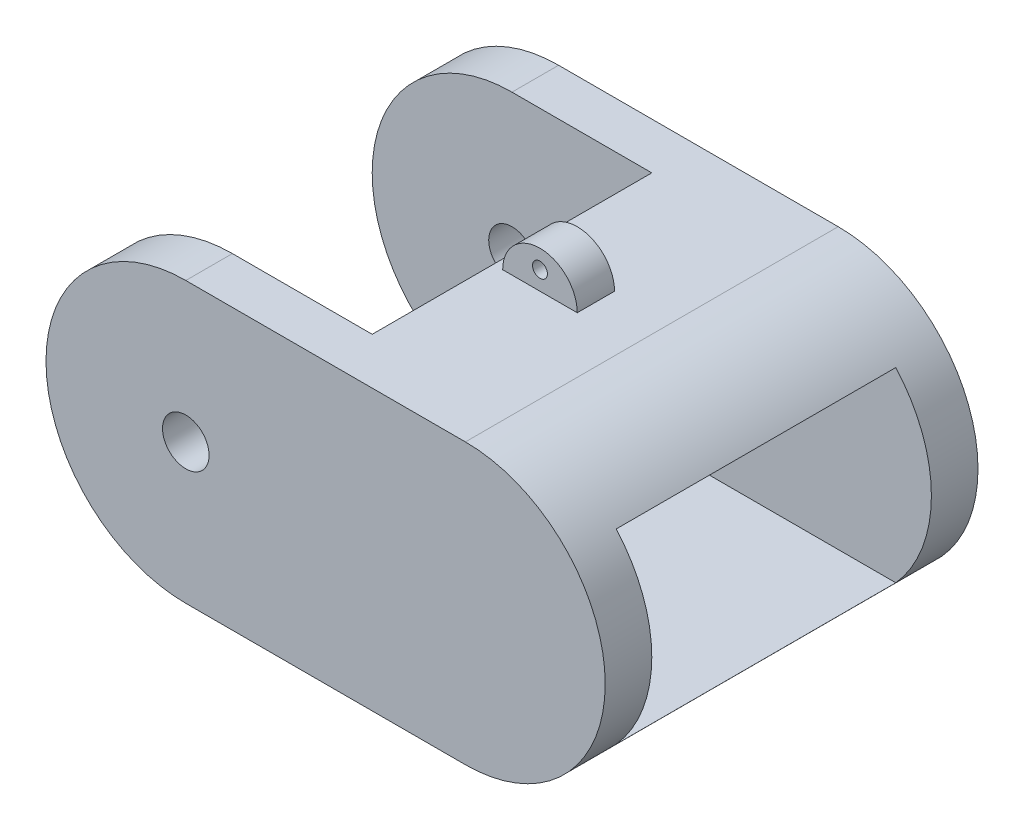
ISO-10303-21;
HEADER;
FILE_DESCRIPTION(('STEP AP214'),'2;1');
FILE_NAME('part.step','',(''),(''),'','','');
FILE_SCHEMA(('AUTOMOTIVE_DESIGN { 1 0 10303 214 1 1 1 1 }'));
ENDSEC;
DATA;
#1=APPLICATION_CONTEXT('core data for automotive mechanical design processes');
#2=APPLICATION_PROTOCOL_DEFINITION('international standard','automotive_design',2000,#1);
#3=PRODUCT_CONTEXT('',#1,'mechanical');
#4=PRODUCT('Part','Part','',(#3));
#5=PRODUCT_RELATED_PRODUCT_CATEGORY('part','',(#4));
#6=PRODUCT_DEFINITION_FORMATION('','',#4);
#7=PRODUCT_DEFINITION_CONTEXT('part definition',#1,'design');
#8=PRODUCT_DEFINITION('design','',#6,#7);
#9=PRODUCT_DEFINITION_SHAPE('','',#8);
#10=(LENGTH_UNIT() NAMED_UNIT(*) SI_UNIT(.MILLI.,.METRE.));
#11=(NAMED_UNIT(*) PLANE_ANGLE_UNIT() SI_UNIT($,.RADIAN.));
#12=(NAMED_UNIT(*) SI_UNIT($,.STERADIAN.) SOLID_ANGLE_UNIT());
#13=UNCERTAINTY_MEASURE_WITH_UNIT(LENGTH_MEASURE(1.E-05),#10,'distance_accuracy_value','');
#14=(GEOMETRIC_REPRESENTATION_CONTEXT(3) GLOBAL_UNCERTAINTY_ASSIGNED_CONTEXT((#13)) GLOBAL_UNIT_ASSIGNED_CONTEXT((#10,
#11,#12)) REPRESENTATION_CONTEXT('',''));
#15=CARTESIAN_POINT('',(0.,0.,0.));
#16=DIRECTION('',(0.,0.,1.));
#17=DIRECTION('',(1.,0.,0.));
#18=AXIS2_PLACEMENT_3D('',#15,#16,#17);
#19=CARTESIAN_POINT('',(-2.54,21.59,1.27));
#20=DIRECTION('',(0.,0.,-1.));
#21=DIRECTION('',(-1.,0.,0.));
#22=AXIS2_PLACEMENT_3D('',#19,#20,#21);
#23=PLANE('',#22);
#24=DIRECTION('',(1.,0.,0.));
#25=VECTOR('',#24,1.);
#26=CARTESIAN_POINT('',(-2.54,19.05,1.27));
#27=LINE('',#26,#25);
#28=CARTESIAN_POINT('',(-2.54,19.05,1.27));
#29=VERTEX_POINT('',#28);
#30=CARTESIAN_POINT('',(2.54,19.05,1.27));
#31=VERTEX_POINT('',#30);
#32=EDGE_CURVE('E291',#29,#31,#27,.T.);
#33=ORIENTED_EDGE('',*,*,#32,.T.);
#34=CARTESIAN_POINT('',(0.,19.05,1.27));
#35=DIRECTION('',(0.,0.,-1.));
#36=DIRECTION('',(-1.,0.,0.));
#37=AXIS2_PLACEMENT_3D('',#34,#35,#36);
#38=CIRCLE('',#37,2.54);
#39=EDGE_CURVE('E275',#31,#29,#38,.F.);
#40=ORIENTED_EDGE('',*,*,#39,.T.);
#41=EDGE_LOOP('',(#33,#40));
#42=FACE_BOUND('',#41,.T.);
#43=CARTESIAN_POINT('',(0.,20.32,1.27));
#44=DIRECTION('',(0.,0.,-1.));
#45=DIRECTION('',(-1.,0.,0.));
#46=AXIS2_PLACEMENT_3D('',#43,#44,#45);
#47=CIRCLE('',#46,0.508000000000001);
#48=CARTESIAN_POINT('',(-0.508000000000002,20.32,1.27));
#49=VERTEX_POINT('',#48);
#50=EDGE_CURVE('E274',#49,#49,#47,.T.);
#51=ORIENTED_EDGE('',*,*,#50,.T.);
#52=EDGE_LOOP('',(#51));
#53=FACE_BOUND('',#52,.T.);
#54=ADVANCED_FACE('F37',(#42,#53),#23,.F.);
#55=CARTESIAN_POINT('',(-2.54,21.59,-1.27));
#56=DIRECTION('',(0.,0.,1.));
#57=DIRECTION('',(1.,0.,0.));
#58=AXIS2_PLACEMENT_3D('',#55,#56,#57);
#59=PLANE('',#58);
#60=DIRECTION('',(-1.,0.,0.));
#61=VECTOR('',#60,1.);
#62=CARTESIAN_POINT('',(-2.54,19.05,-1.27));
#63=LINE('',#62,#61);
#64=CARTESIAN_POINT('',(2.54,19.05,-1.27));
#65=VERTEX_POINT('',#64);
#66=CARTESIAN_POINT('',(-2.54,19.05,-1.27));
#67=VERTEX_POINT('',#66);
#68=EDGE_CURVE('E294',#65,#67,#63,.T.);
#69=ORIENTED_EDGE('',*,*,#68,.T.);
#70=CARTESIAN_POINT('',(0.,19.05,-1.27));
#71=DIRECTION('',(0.,0.,1.));
#72=DIRECTION('',(1.,0.,0.));
#73=AXIS2_PLACEMENT_3D('',#70,#71,#72);
#74=CIRCLE('',#73,2.54);
#75=EDGE_CURVE('E281',#67,#65,#74,.F.);
#76=ORIENTED_EDGE('',*,*,#75,.T.);
#77=EDGE_LOOP('',(#69,#76));
#78=FACE_BOUND('',#77,.T.);
#79=CARTESIAN_POINT('',(0.,20.32,-1.27));
#80=DIRECTION('',(0.,0.,1.));
#81=DIRECTION('',(1.,0.,0.));
#82=AXIS2_PLACEMENT_3D('',#79,#80,#81);
#83=CIRCLE('',#82,0.508000000000001);
#84=CARTESIAN_POINT('',(0.508000000000001,20.32,-1.27));
#85=VERTEX_POINT('',#84);
#86=EDGE_CURVE('E272',#85,#85,#83,.T.);
#87=ORIENTED_EDGE('',*,*,#86,.T.);
#88=EDGE_LOOP('',(#87));
#89=FACE_BOUND('',#88,.T.);
#90=ADVANCED_FACE('F425',(#78,#89),#59,.F.);
#91=CARTESIAN_POINT('',(0.,19.05,0.));
#92=DIRECTION('',(0.,1.,0.));
#93=DIRECTION('',(0.,0.,1.));
#94=AXIS2_PLACEMENT_3D('',#91,#92,#93);
#95=PLANE('',#94);
#96=DIRECTION('',(-1.,0.,0.));
#97=VECTOR('',#96,1.);
#98=CARTESIAN_POINT('',(-12.7,19.05,-9.525));
#99=LINE('',#98,#97);
#100=CARTESIAN_POINT('',(-3.175,19.05,-9.525));
#101=VERTEX_POINT('',#100);
#102=CARTESIAN_POINT('',(-12.7,19.05,-9.525));
#103=VERTEX_POINT('',#102);
#104=EDGE_CURVE('E388',#101,#103,#99,.T.);
#105=ORIENTED_EDGE('',*,*,#104,.F.);
#106=DIRECTION('',(0.,0.,-1.));
#107=VECTOR('',#106,1.);
#108=CARTESIAN_POINT('',(-3.175,19.05,-9.525));
#109=LINE('',#108,#107);
#110=CARTESIAN_POINT('',(-3.175,19.05,9.525));
#111=VERTEX_POINT('',#110);
#112=EDGE_CURVE('E194',#111,#101,#109,.T.);
#113=ORIENTED_EDGE('',*,*,#112,.F.);
#114=DIRECTION('',(1.,0.,0.));
#115=VECTOR('',#114,1.);
#116=CARTESIAN_POINT('',(-12.7,19.05,9.525));
#117=LINE('',#116,#115);
#118=CARTESIAN_POINT('',(-12.7,19.05,9.525));
#119=VERTEX_POINT('',#118);
#120=EDGE_CURVE('E185',#119,#111,#117,.T.);
#121=ORIENTED_EDGE('',*,*,#120,.F.);
#122=DIRECTION('',(0.,0.,1.));
#123=VECTOR('',#122,1.);
#124=CARTESIAN_POINT('',(-12.7,19.05,-12.7));
#125=LINE('',#124,#123);
#126=CARTESIAN_POINT('',(-12.7,19.05,12.7));
#127=VERTEX_POINT('',#126);
#128=EDGE_CURVE('E191',#119,#127,#125,.T.);
#129=ORIENTED_EDGE('',*,*,#128,.T.);
#130=DIRECTION('',(1.,0.,0.));
#131=VECTOR('',#130,1.);
#132=CARTESIAN_POINT('',(-22.225,19.05,12.7));
#133=LINE('',#132,#131);
#134=CARTESIAN_POINT('',(6.35,19.05,12.7));
#135=VERTEX_POINT('',#134);
#136=EDGE_CURVE('E242',#127,#135,#133,.T.);
#137=ORIENTED_EDGE('',*,*,#136,.T.);
#138=DIRECTION('',(0.,0.,1.));
#139=VECTOR('',#138,1.);
#140=CARTESIAN_POINT('',(6.35,19.05,-12.7));
#141=LINE('',#140,#139);
#142=CARTESIAN_POINT('',(6.35,19.05,-12.7));
#143=VERTEX_POINT('',#142);
#144=EDGE_CURVE('E227',#143,#135,#141,.T.);
#145=ORIENTED_EDGE('',*,*,#144,.F.);
#146=DIRECTION('',(-1.,0.,0.));
#147=VECTOR('',#146,1.);
#148=CARTESIAN_POINT('',(-22.225,19.05,-12.7));
#149=LINE('',#148,#147);
#150=CARTESIAN_POINT('',(-12.7,19.05,-12.7));
#151=VERTEX_POINT('',#150);
#152=EDGE_CURVE('E244',#143,#151,#149,.T.);
#153=ORIENTED_EDGE('',*,*,#152,.T.);
#154=EDGE_CURVE('E213',#151,#103,#125,.T.);
#155=ORIENTED_EDGE('',*,*,#154,.T.);
#156=EDGE_LOOP('',(#105,#113,#121,#129,#137,#145,#153,#155));
#157=FACE_BOUND('',#156,.T.);
#158=ORIENTED_EDGE('',*,*,#32,.F.);
#159=DIRECTION('',(0.,0.,1.));
#160=VECTOR('',#159,1.);
#161=CARTESIAN_POINT('',(-2.54,19.05,-1.27));
#162=LINE('',#161,#160);
#163=EDGE_CURVE('E279',#67,#29,#162,.T.);
#164=ORIENTED_EDGE('',*,*,#163,.F.);
#165=ORIENTED_EDGE('',*,*,#68,.F.);
#166=DIRECTION('',(0.,0.,-1.));
#167=VECTOR('',#166,1.);
#168=CARTESIAN_POINT('',(2.54,19.05,-1.27));
#169=LINE('',#168,#167);
#170=EDGE_CURVE('E59',#31,#65,#169,.T.);
#171=ORIENTED_EDGE('',*,*,#170,.F.);
#172=EDGE_LOOP('',(#158,#164,#165,#171));
#173=FACE_BOUND('',#172,.T.);
#174=ADVANCED_FACE('F188',(#157,#173),#95,.T.);
#175=CARTESIAN_POINT('',(-6.35,-7.62,-1.90500000000001));
#176=DIRECTION('',(0.,0.,-1.));
#177=DIRECTION('',(-1.,0.,0.));
#178=AXIS2_PLACEMENT_3D('',#175,#176,#177);
#179=PLANE('',#178);
#180=CARTESIAN_POINT('',(-0.0861930186881812,-2.99485448456808,-1.90500000000001));
#181=DIRECTION('',(0.,0.,-1.));
#182=DIRECTION('',(-1.,0.,0.));
#183=AXIS2_PLACEMENT_3D('',#180,#181,#182);
#184=CIRCLE('',#183,4.34412957457592);
#185=CARTESIAN_POINT('',(-4.41362492439032,-2.614335283717,-1.90500000000002));
#186=VERTEX_POINT('',#185);
#187=CARTESIAN_POINT('',(-3.23298636699812,0.,-1.90500000000002));
#188=VERTEX_POINT('',#187);
#189=EDGE_CURVE('E323',#186,#188,#184,.T.);
#190=ORIENTED_EDGE('',*,*,#189,.F.);
#191=CARTESIAN_POINT('',(-2.26854868254507,-2.28495035036065,-1.90500000000001));
#192=DIRECTION('',(0.,0.,-1.));
#193=DIRECTION('',(-1.,0.,0.));
#194=AXIS2_PLACEMENT_3D('',#191,#192,#193);
#195=CIRCLE('',#194,2.17021808066635);
#196=CARTESIAN_POINT('',(-3.04450374837902,-4.31170644162021,-1.90500000000002));
#197=VERTEX_POINT('',#196);
#198=EDGE_CURVE('E325',#197,#186,#195,.T.);
#199=ORIENTED_EDGE('',*,*,#198,.F.);
#200=CARTESIAN_POINT('',(-3.3233412187691,-2.19000144979784,-1.90500000000001));
#201=DIRECTION('',(0.,0.,-1.));
#202=DIRECTION('',(-1.,0.,0.));
#203=AXIS2_PLACEMENT_3D('',#200,#201,#202);
#204=CIRCLE('',#203,2.13994915996094);
#205=CARTESIAN_POINT('',(-1.31460402965717,-2.92780719136958,-1.90500000000002));
#206=VERTEX_POINT('',#205);
#207=EDGE_CURVE('E327',#206,#197,#204,.T.);
#208=ORIENTED_EDGE('',*,*,#207,.F.);
#209=CARTESIAN_POINT('',(-1.96109230852822,-2.92882586705521,-1.90500000000001));
#210=DIRECTION('',(0.,0.,-1.));
#211=DIRECTION('',(-1.,0.,0.));
#212=AXIS2_PLACEMENT_3D('',#209,#210,#211);
#213=CIRCLE('',#212,0.646489081437423);
#214=CARTESIAN_POINT('',(-2.21183198517268,-2.33294186242509,-1.90500000000002));
#215=VERTEX_POINT('',#214);
#216=EDGE_CURVE('E329',#215,#206,#213,.T.);
#217=ORIENTED_EDGE('',*,*,#216,.F.);
#218=CARTESIAN_POINT('',(-2.0593410105954,-1.72984424301921,-1.90500000000001));
#219=DIRECTION('',(0.,0.,-1.));
#220=DIRECTION('',(-1.,0.,0.));
#221=AXIS2_PLACEMENT_3D('',#218,#219,#220);
#222=CIRCLE('',#221,0.622077355206385);
#223=CARTESIAN_POINT('',(-1.90685003601812,-1.12674662361332,-1.90500000000002));
#224=VERTEX_POINT('',#223);
#225=EDGE_CURVE('E331',#224,#215,#222,.F.);
#226=ORIENTED_EDGE('',*,*,#225,.F.);
#227=CARTESIAN_POINT('',(-1.81149307872842,-2.77193940872848,-1.90500000000001));
#228=DIRECTION('',(0.,0.,-1.));
#229=DIRECTION('',(-1.,0.,0.));
#230=AXIS2_PLACEMENT_3D('',#227,#228,#229);
#231=CIRCLE('',#230,1.64795395854936);
#232=CARTESIAN_POINT('',(-0.163539125899153,-2.77180210276902,-1.90500000000002));
#233=VERTEX_POINT('',#232);
#234=EDGE_CURVE('E333',#233,#224,#231,.F.);
#235=ORIENTED_EDGE('',*,*,#234,.F.);
#236=CARTESIAN_POINT('',(-3.15358954399178,-2.81445182249442,-1.90500000000001));
#237=DIRECTION('',(0.,0.,-1.));
#238=DIRECTION('',(-1.,0.,0.));
#239=AXIS2_PLACEMENT_3D('',#236,#237,#238);
#240=CIRCLE('',#239,2.99035457786005);
#241=CARTESIAN_POINT('',(-6.12706480359468,-3.13172990534612,-1.90500000000002));
#242=VERTEX_POINT('',#241);
#243=EDGE_CURVE('E301',#242,#233,#240,.F.);
#244=ORIENTED_EDGE('',*,*,#243,.F.);
#245=DIRECTION('',(0.0710062762211976,-0.997475868749314,0.));
#246=VECTOR('',#245,1.);
#247=CARTESIAN_POINT('',(-5.81029790139981,-7.58158078857746,-1.90500000000001));
#248=LINE('',#247,#246);
#249=CARTESIAN_POINT('',(-6.35,0.,-1.90500000000002));
#250=VERTEX_POINT('',#249);
#251=EDGE_CURVE('E321',#250,#242,#248,.T.);
#252=ORIENTED_EDGE('',*,*,#251,.F.);
#253=DIRECTION('',(-1.,0.,0.));
#254=VECTOR('',#253,1.);
#255=CARTESIAN_POINT('',(-6.35,0.,-1.90500000000001));
#256=LINE('',#255,#254);
#257=EDGE_CURVE('E341',#188,#250,#256,.T.);
#258=ORIENTED_EDGE('',*,*,#257,.F.);
#259=EDGE_LOOP('',(#190,#199,#208,#217,#226,#235,#244,#252,#258));
#260=FACE_BOUND('',#259,.T.);
#261=ADVANCED_FACE('F467',(#260),#179,.T.);
#262=CARTESIAN_POINT('',(-6.35,-7.62,1.90499999999999));
#263=DIRECTION('',(0.,0.,1.));
#264=DIRECTION('',(1.,0.,0.));
#265=AXIS2_PLACEMENT_3D('',#262,#263,#264);
#266=PLANE('',#265);
#267=CARTESIAN_POINT('',(-0.0861930186881812,-2.99485448456808,1.90499999999998));
#268=DIRECTION('',(0.,0.,1.));
#269=DIRECTION('',(1.,0.,0.));
#270=AXIS2_PLACEMENT_3D('',#267,#268,#269);
#271=CIRCLE('',#270,4.34412957457592);
#272=CARTESIAN_POINT('',(-3.23298636699812,0.,1.90499999999998));
#273=VERTEX_POINT('',#272);
#274=CARTESIAN_POINT('',(-4.41362492439032,-2.614335283717,1.90499999999998));
#275=VERTEX_POINT('',#274);
#276=EDGE_CURVE('E45',#273,#275,#271,.T.);
#277=ORIENTED_EDGE('',*,*,#276,.F.);
#278=DIRECTION('',(1.,0.,0.));
#279=VECTOR('',#278,1.);
#280=CARTESIAN_POINT('',(-6.35,0.,1.90499999999999));
#281=LINE('',#280,#279);
#282=CARTESIAN_POINT('',(-6.35,0.,1.90499999999998));
#283=VERTEX_POINT('',#282);
#284=EDGE_CURVE('E338',#283,#273,#281,.T.);
#285=ORIENTED_EDGE('',*,*,#284,.F.);
#286=DIRECTION('',(-0.0710062762211976,0.997475868749314,0.));
#287=VECTOR('',#286,1.);
#288=CARTESIAN_POINT('',(-5.81029790139981,-7.58158078857746,1.90499999999999));
#289=LINE('',#288,#287);
#290=CARTESIAN_POINT('',(-6.12706480359468,-3.13172990534612,1.90499999999998));
#291=VERTEX_POINT('',#290);
#292=EDGE_CURVE('E259',#291,#283,#289,.T.);
#293=ORIENTED_EDGE('',*,*,#292,.F.);
#294=CARTESIAN_POINT('',(-3.15358954399178,-2.81445182249442,1.90499999999998));
#295=DIRECTION('',(0.,0.,1.));
#296=DIRECTION('',(1.,0.,0.));
#297=AXIS2_PLACEMENT_3D('',#294,#295,#296);
#298=CIRCLE('',#297,2.99035457786005);
#299=CARTESIAN_POINT('',(-0.163539125899152,-2.77180210276902,1.90499999999998));
#300=VERTEX_POINT('',#299);
#301=EDGE_CURVE('E257',#300,#291,#298,.F.);
#302=ORIENTED_EDGE('',*,*,#301,.F.);
#303=CARTESIAN_POINT('',(-1.81149307872842,-2.77193940872848,1.90499999999998));
#304=DIRECTION('',(0.,0.,1.));
#305=DIRECTION('',(1.,0.,0.));
#306=AXIS2_PLACEMENT_3D('',#303,#304,#305);
#307=CIRCLE('',#306,1.64795395854936);
#308=CARTESIAN_POINT('',(-1.90685003601812,-1.12674662361332,1.90499999999998));
#309=VERTEX_POINT('',#308);
#310=EDGE_CURVE('E261',#309,#300,#307,.F.);
#311=ORIENTED_EDGE('',*,*,#310,.F.);
#312=CARTESIAN_POINT('',(-2.0593410105954,-1.72984424301921,1.90499999999998));
#313=DIRECTION('',(0.,0.,1.));
#314=DIRECTION('',(1.,0.,0.));
#315=AXIS2_PLACEMENT_3D('',#312,#313,#314);
#316=CIRCLE('',#315,0.622077355206385);
#317=CARTESIAN_POINT('',(-2.21183198517268,-2.33294186242509,1.90499999999998));
#318=VERTEX_POINT('',#317);
#319=EDGE_CURVE('E264',#318,#309,#316,.F.);
#320=ORIENTED_EDGE('',*,*,#319,.F.);
#321=CARTESIAN_POINT('',(-1.96109230852822,-2.92882586705521,1.90499999999998));
#322=DIRECTION('',(0.,0.,1.));
#323=DIRECTION('',(1.,0.,0.));
#324=AXIS2_PLACEMENT_3D('',#321,#322,#323);
#325=CIRCLE('',#324,0.646489081437423);
#326=CARTESIAN_POINT('',(-1.31460402965717,-2.92780719136958,1.90499999999998));
#327=VERTEX_POINT('',#326);
#328=EDGE_CURVE('E266',#327,#318,#325,.T.);
#329=ORIENTED_EDGE('',*,*,#328,.F.);
#330=CARTESIAN_POINT('',(-3.3233412187691,-2.19000144979784,1.90499999999998));
#331=DIRECTION('',(0.,0.,1.));
#332=DIRECTION('',(1.,0.,0.));
#333=AXIS2_PLACEMENT_3D('',#330,#331,#332);
#334=CIRCLE('',#333,2.13994915996094);
#335=CARTESIAN_POINT('',(-3.04450374837902,-4.31170644162021,1.90499999999998));
#336=VERTEX_POINT('',#335);
#337=EDGE_CURVE('E268',#336,#327,#334,.T.);
#338=ORIENTED_EDGE('',*,*,#337,.F.);
#339=CARTESIAN_POINT('',(-2.26854868254507,-2.28495035036065,1.90499999999998));
#340=DIRECTION('',(0.,0.,1.));
#341=DIRECTION('',(1.,0.,0.));
#342=AXIS2_PLACEMENT_3D('',#339,#340,#341);
#343=CIRCLE('',#342,2.17021808066635);
#344=EDGE_CURVE('E270',#275,#336,#343,.T.);
#345=ORIENTED_EDGE('',*,*,#344,.F.);
#346=EDGE_LOOP('',(#277,#285,#293,#302,#311,#320,#329,#338,#345));
#347=FACE_BOUND('',#346,.T.);
#348=ADVANCED_FACE('F470',(#347),#266,.T.);
#349=CARTESIAN_POINT('',(6.35,9.525,-12.7));
#350=DIRECTION('',(0.,0.,1.));
#351=DIRECTION('',(1.,0.,0.));
#352=AXIS2_PLACEMENT_3D('',#349,#350,#351);
#353=CYLINDRICAL_SURFACE('',#352,9.525);
#354=CARTESIAN_POINT('',(6.35,9.525,12.7));
#355=DIRECTION('',(0.,0.,-1.));
#356=DIRECTION('',(1.,0.,0.));
#357=AXIS2_PLACEMENT_3D('',#354,#355,#356);
#358=CIRCLE('',#357,9.525);
#359=CARTESIAN_POINT('',(6.34999999999999,0.,12.7));
#360=VERTEX_POINT('',#359);
#361=EDGE_CURVE('E228',#135,#360,#358,.T.);
#362=ORIENTED_EDGE('',*,*,#361,.T.);
#363=DIRECTION('',(0.,0.,1.));
#364=VECTOR('',#363,1.);
#365=CARTESIAN_POINT('',(6.35,0.,-12.7));
#366=LINE('',#365,#364);
#367=CARTESIAN_POINT('',(6.35,0.,-12.7));
#368=VERTEX_POINT('',#367);
#369=EDGE_CURVE('E231',#368,#360,#366,.T.);
#370=ORIENTED_EDGE('',*,*,#369,.F.);
#371=CARTESIAN_POINT('',(6.35,9.525,-12.7));
#372=DIRECTION('',(0.,0.,-1.));
#373=DIRECTION('',(1.,0.,0.));
#374=AXIS2_PLACEMENT_3D('',#371,#372,#373);
#375=CIRCLE('',#374,9.525);
#376=EDGE_CURVE('E224',#143,#368,#375,.T.);
#377=ORIENTED_EDGE('',*,*,#376,.F.);
#378=ORIENTED_EDGE('',*,*,#144,.T.);
#379=EDGE_LOOP('',(#362,#370,#377,#378));
#380=FACE_BOUND('',#379,.T.);
#381=CARTESIAN_POINT('',(6.35,9.525,-9.525));
#382=DIRECTION('',(0.,0.,1.));
#383=DIRECTION('',(0.,-1.,0.));
#384=AXIS2_PLACEMENT_3D('',#381,#382,#383);
#385=CIRCLE('',#384,9.525);
#386=CARTESIAN_POINT('',(13.4495158285618,3.175,-9.525));
#387=VERTEX_POINT('',#386);
#388=CARTESIAN_POINT('',(13.4495158285618,15.875,-9.525));
#389=VERTEX_POINT('',#388);
#390=EDGE_CURVE('E363',#387,#389,#385,.T.);
#391=ORIENTED_EDGE('',*,*,#390,.F.);
#392=DIRECTION('',(0.,0.,1.));
#393=VECTOR('',#392,1.);
#394=CARTESIAN_POINT('',(13.4495158285618,3.175,-12.7));
#395=LINE('',#394,#393);
#396=CARTESIAN_POINT('',(13.4495158285618,3.175,9.525));
#397=VERTEX_POINT('',#396);
#398=EDGE_CURVE('E356',#397,#387,#395,.F.);
#399=ORIENTED_EDGE('',*,*,#398,.F.);
#400=CARTESIAN_POINT('',(6.35,9.525,9.525));
#401=DIRECTION('',(0.,0.,-1.));
#402=DIRECTION('',(0.,1.,0.));
#403=AXIS2_PLACEMENT_3D('',#400,#401,#402);
#404=CIRCLE('',#403,9.525);
#405=CARTESIAN_POINT('',(13.4495158285618,15.875,9.525));
#406=VERTEX_POINT('',#405);
#407=EDGE_CURVE('E360',#406,#397,#404,.T.);
#408=ORIENTED_EDGE('',*,*,#407,.F.);
#409=DIRECTION('',(0.,0.,1.));
#410=VECTOR('',#409,1.);
#411=CARTESIAN_POINT('',(13.4495158285618,15.875,-12.7));
#412=LINE('',#411,#410);
#413=EDGE_CURVE('E358',#389,#406,#412,.T.);
#414=ORIENTED_EDGE('',*,*,#413,.F.);
#415=EDGE_LOOP('',(#391,#399,#408,#414));
#416=FACE_BOUND('',#415,.T.);
#417=ADVANCED_FACE('F384',(#380,#416),#353,.T.);
#418=CARTESIAN_POINT('',(-12.7,9.525,-12.7));
#419=DIRECTION('',(0.,0.,1.));
#420=DIRECTION('',(1.,0.,0.));
#421=AXIS2_PLACEMENT_3D('',#418,#419,#420);
#422=CYLINDRICAL_SURFACE('',#421,1.5875);
#423=CARTESIAN_POINT('',(-12.7,9.525,-12.7));
#424=DIRECTION('',(0.,0.,1.));
#425=DIRECTION('',(1.,0.,0.));
#426=AXIS2_PLACEMENT_3D('',#423,#424,#425);
#427=CIRCLE('',#426,1.5875);
#428=CARTESIAN_POINT('',(-11.1125,9.525,-12.7));
#429=VERTEX_POINT('',#428);
#430=EDGE_CURVE('E236',#429,#429,#427,.T.);
#431=ORIENTED_EDGE('',*,*,#430,.F.);
#432=EDGE_LOOP('',(#431));
#433=FACE_BOUND('',#432,.T.);
#434=CARTESIAN_POINT('',(-12.7,9.525,-9.525));
#435=DIRECTION('',(0.,0.,-1.));
#436=DIRECTION('',(-1.,0.,0.));
#437=AXIS2_PLACEMENT_3D('',#434,#435,#436);
#438=CIRCLE('',#437,1.5875);
#439=CARTESIAN_POINT('',(-14.2875,9.525,-9.525));
#440=VERTEX_POINT('',#439);
#441=EDGE_CURVE('E254',#440,#440,#438,.F.);
#442=ORIENTED_EDGE('',*,*,#441,.T.);
#443=EDGE_LOOP('',(#442));
#444=FACE_BOUND('',#443,.T.);
#445=ADVANCED_FACE('F490',(#433,#444),#422,.F.);
#446=CARTESIAN_POINT('',(-12.7,9.525,12.7));
#447=DIRECTION('',(0.,0.,1.));
#448=DIRECTION('',(1.,0.,0.));
#449=AXIS2_PLACEMENT_3D('',#446,#447,#448);
#450=CIRCLE('',#449,1.5875);
#451=CARTESIAN_POINT('',(-11.1125,9.525,12.7));
#452=VERTEX_POINT('',#451);
#453=EDGE_CURVE('E217',#452,#452,#450,.T.);
#454=ORIENTED_EDGE('',*,*,#453,.T.);
#455=EDGE_LOOP('',(#454));
#456=FACE_BOUND('',#455,.T.);
#457=CARTESIAN_POINT('',(-12.7,9.525,9.525));
#458=DIRECTION('',(0.,0.,1.));
#459=DIRECTION('',(1.,0.,0.));
#460=AXIS2_PLACEMENT_3D('',#457,#458,#459);
#461=CIRCLE('',#460,1.5875);
#462=CARTESIAN_POINT('',(-11.1125,9.525,9.525));
#463=VERTEX_POINT('',#462);
#464=EDGE_CURVE('E248',#463,#463,#461,.F.);
#465=ORIENTED_EDGE('',*,*,#464,.T.);
#466=EDGE_LOOP('',(#465));
#467=FACE_BOUND('',#466,.T.);
#468=ADVANCED_FACE('F481',(#456,#467),#422,.F.);
#469=CARTESIAN_POINT('',(-12.7,0.,-9.525));
#470=DIRECTION('',(1.,0.,0.));
#471=DIRECTION('',(0.,0.,-1.));
#472=AXIS2_PLACEMENT_3D('',#469,#470,#471);
#473=PLANE('',#472);
#474=DIRECTION('',(0.,0.,1.));
#475=VECTOR('',#474,1.);
#476=CARTESIAN_POINT('',(-12.7,3.175,-9.525));
#477=LINE('',#476,#475);
#478=CARTESIAN_POINT('',(-12.7,3.175,-9.525));
#479=VERTEX_POINT('',#478);
#480=CARTESIAN_POINT('',(-12.7,3.175,9.525));
#481=VERTEX_POINT('',#480);
#482=EDGE_CURVE('E354',#479,#481,#477,.T.);
#483=ORIENTED_EDGE('',*,*,#482,.F.);
#484=DIRECTION('',(0.,1.,0.));
#485=VECTOR('',#484,1.);
#486=CARTESIAN_POINT('',(-12.7,0.,-9.525));
#487=LINE('',#486,#485);
#488=CARTESIAN_POINT('',(-12.7,0.,-9.525));
#489=VERTEX_POINT('',#488);
#490=EDGE_CURVE('E207',#489,#479,#487,.T.);
#491=ORIENTED_EDGE('',*,*,#490,.F.);
#492=DIRECTION('',(0.,0.,-1.));
#493=VECTOR('',#492,1.);
#494=CARTESIAN_POINT('',(-12.7,0.,-9.525));
#495=LINE('',#494,#493);
#496=CARTESIAN_POINT('',(-12.7,0.,9.525));
#497=VERTEX_POINT('',#496);
#498=EDGE_CURVE('E365',#497,#489,#495,.T.);
#499=ORIENTED_EDGE('',*,*,#498,.F.);
#500=DIRECTION('',(0.,1.,0.));
#501=VECTOR('',#500,1.);
#502=CARTESIAN_POINT('',(-12.7,0.,9.525));
#503=LINE('',#502,#501);
#504=EDGE_CURVE('E202',#497,#481,#503,.T.);
#505=ORIENTED_EDGE('',*,*,#504,.T.);
#506=EDGE_LOOP('',(#483,#491,#499,#505));
#507=FACE_BOUND('',#506,.T.);
#508=ADVANCED_FACE('F399',(#507),#473,.F.);
#509=CARTESIAN_POINT('',(-12.7,9.525,-12.7));
#510=DIRECTION('',(0.,0.,1.));
#511=DIRECTION('',(1.,0.,0.));
#512=AXIS2_PLACEMENT_3D('',#509,#510,#511);
#513=CYLINDRICAL_SURFACE('',#512,9.525);
#514=DIRECTION('',(0.,0.,1.));
#515=VECTOR('',#514,1.);
#516=CARTESIAN_POINT('',(-12.7,0.,-12.7));
#517=LINE('',#516,#515);
#518=CARTESIAN_POINT('',(-12.7,0.,-12.7));
#519=VERTEX_POINT('',#518);
#520=EDGE_CURVE('E214',#519,#489,#517,.T.);
#521=ORIENTED_EDGE('',*,*,#520,.T.);
#522=CARTESIAN_POINT('',(-12.7,9.525,-9.525));
#523=DIRECTION('',(0.,0.,-1.));
#524=DIRECTION('',(-1.,0.,0.));
#525=AXIS2_PLACEMENT_3D('',#522,#523,#524);
#526=CIRCLE('',#525,9.525);
#527=EDGE_CURVE('E206',#489,#103,#526,.T.);
#528=ORIENTED_EDGE('',*,*,#527,.T.);
#529=ORIENTED_EDGE('',*,*,#154,.F.);
#530=CARTESIAN_POINT('',(-12.7,9.525,-12.7));
#531=DIRECTION('',(0.,0.,-1.));
#532=DIRECTION('',(1.,0.,0.));
#533=AXIS2_PLACEMENT_3D('',#530,#531,#532);
#534=CIRCLE('',#533,9.525);
#535=EDGE_CURVE('E371',#519,#151,#534,.T.);
#536=ORIENTED_EDGE('',*,*,#535,.F.);
#537=EDGE_LOOP('',(#521,#528,#529,#536));
#538=FACE_BOUND('',#537,.T.);
#539=ADVANCED_FACE('F390',(#538),#513,.T.);
#540=CARTESIAN_POINT('',(0.,0.,0.));
#541=DIRECTION('',(0.,1.,0.));
#542=DIRECTION('',(0.,0.,1.));
#543=AXIS2_PLACEMENT_3D('',#540,#541,#542);
#544=PLANE('',#543);
#545=ORIENTED_EDGE('',*,*,#369,.T.);
#546=DIRECTION('',(1.,0.,0.));
#547=VECTOR('',#546,1.);
#548=CARTESIAN_POINT('',(-22.225,0.,12.7));
#549=LINE('',#548,#547);
#550=CARTESIAN_POINT('',(-12.7,0.,12.7));
#551=VERTEX_POINT('',#550);
#552=EDGE_CURVE('E239',#551,#360,#549,.T.);
#553=ORIENTED_EDGE('',*,*,#552,.F.);
#554=EDGE_CURVE('E219',#497,#551,#517,.T.);
#555=ORIENTED_EDGE('',*,*,#554,.F.);
#556=ORIENTED_EDGE('',*,*,#498,.T.);
#557=ORIENTED_EDGE('',*,*,#520,.F.);
#558=DIRECTION('',(-1.,0.,0.));
#559=VECTOR('',#558,1.);
#560=CARTESIAN_POINT('',(-22.225,0.,-12.7));
#561=LINE('',#560,#559);
#562=EDGE_CURVE('E245',#368,#519,#561,.T.);
#563=ORIENTED_EDGE('',*,*,#562,.F.);
#564=EDGE_LOOP('',(#545,#553,#555,#556,#557,#563));
#565=FACE_BOUND('',#564,.T.);
#566=DIRECTION('',(0.,0.,1.));
#567=VECTOR('',#566,1.);
#568=CARTESIAN_POINT('',(-3.23298636699812,0.,-6.35));
#569=LINE('',#568,#567);
#570=EDGE_CURVE('E314',#188,#273,#569,.T.);
#571=ORIENTED_EDGE('',*,*,#570,.F.);
#572=ORIENTED_EDGE('',*,*,#257,.T.);
#573=DIRECTION('',(0.,0.,1.));
#574=VECTOR('',#573,1.);
#575=CARTESIAN_POINT('',(-6.35,0.,1.90499999999999));
#576=LINE('',#575,#574);
#577=EDGE_CURVE('E335',#250,#283,#576,.T.);
#578=ORIENTED_EDGE('',*,*,#577,.T.);
#579=ORIENTED_EDGE('',*,*,#284,.T.);
#580=EDGE_LOOP('',(#571,#572,#578,#579));
#581=FACE_BOUND('',#580,.T.);
#582=ADVANCED_FACE('F379',(#565,#581),#544,.F.);
#583=CARTESIAN_POINT('',(-22.225,19.05,12.7));
#584=DIRECTION('',(0.,0.,-1.));
#585=DIRECTION('',(-1.,0.,0.));
#586=AXIS2_PLACEMENT_3D('',#583,#584,#585);
#587=PLANE('',#586);
#588=ORIENTED_EDGE('',*,*,#453,.F.);
#589=EDGE_LOOP('',(#588));
#590=FACE_BOUND('',#589,.T.);
#591=ORIENTED_EDGE('',*,*,#552,.T.);
#592=ORIENTED_EDGE('',*,*,#361,.F.);
#593=ORIENTED_EDGE('',*,*,#136,.F.);
#594=CARTESIAN_POINT('',(-12.7,9.525,12.7));
#595=DIRECTION('',(0.,0.,-1.));
#596=DIRECTION('',(1.,0.,0.));
#597=AXIS2_PLACEMENT_3D('',#594,#595,#596);
#598=CIRCLE('',#597,9.525);
#599=EDGE_CURVE('E211',#551,#127,#598,.T.);
#600=ORIENTED_EDGE('',*,*,#599,.F.);
#601=EDGE_LOOP('',(#591,#592,#593,#600));
#602=FACE_BOUND('',#601,.T.);
#603=ADVANCED_FACE('F39',(#590,#602),#587,.F.);
#604=CARTESIAN_POINT('',(-22.225,19.05,-12.7));
#605=DIRECTION('',(0.,0.,1.));
#606=DIRECTION('',(1.,0.,0.));
#607=AXIS2_PLACEMENT_3D('',#604,#605,#606);
#608=PLANE('',#607);
#609=ORIENTED_EDGE('',*,*,#430,.T.);
#610=EDGE_LOOP('',(#609));
#611=FACE_BOUND('',#610,.T.);
#612=ORIENTED_EDGE('',*,*,#152,.F.);
#613=ORIENTED_EDGE('',*,*,#376,.T.);
#614=ORIENTED_EDGE('',*,*,#562,.T.);
#615=ORIENTED_EDGE('',*,*,#535,.T.);
#616=EDGE_LOOP('',(#612,#613,#614,#615));
#617=FACE_BOUND('',#616,.T.);
#618=ADVANCED_FACE('F387',(#611,#617),#608,.F.);
#619=ORIENTED_EDGE('',*,*,#128,.F.);
#620=CARTESIAN_POINT('',(-12.7,9.525,9.525));
#621=DIRECTION('',(0.,0.,1.));
#622=DIRECTION('',(1.,0.,0.));
#623=AXIS2_PLACEMENT_3D('',#620,#621,#622);
#624=CIRCLE('',#623,9.525);
#625=EDGE_CURVE('E197',#119,#497,#624,.T.);
#626=ORIENTED_EDGE('',*,*,#625,.T.);
#627=ORIENTED_EDGE('',*,*,#554,.T.);
#628=ORIENTED_EDGE('',*,*,#599,.T.);
#629=EDGE_LOOP('',(#619,#626,#627,#628));
#630=FACE_BOUND('',#629,.T.);
#631=ADVANCED_FACE('F209',(#630),#513,.T.);
#632=CARTESIAN_POINT('',(-24.8084462993451,0.,-9.525));
#633=DIRECTION('',(0.,0.,-1.));
#634=DIRECTION('',(-1.,0.,0.));
#635=AXIS2_PLACEMENT_3D('',#632,#633,#634);
#636=PLANE('',#635);
#637=ORIENTED_EDGE('',*,*,#104,.T.);
#638=ORIENTED_EDGE('',*,*,#527,.F.);
#639=ORIENTED_EDGE('',*,*,#490,.T.);
#640=DIRECTION('',(-1.,0.,0.));
#641=VECTOR('',#640,1.);
#642=CARTESIAN_POINT('',(34.925,3.175,-9.525));
#643=LINE('',#642,#641);
#644=EDGE_CURVE('E344',#387,#479,#643,.T.);
#645=ORIENTED_EDGE('',*,*,#644,.F.);
#646=ORIENTED_EDGE('',*,*,#390,.T.);
#647=DIRECTION('',(-1.,0.,0.));
#648=VECTOR('',#647,1.);
#649=CARTESIAN_POINT('',(34.925,15.875,-9.525));
#650=LINE('',#649,#648);
#651=CARTESIAN_POINT('',(-3.175,15.875,-9.525));
#652=VERTEX_POINT('',#651);
#653=EDGE_CURVE('E351',#389,#652,#650,.T.);
#654=ORIENTED_EDGE('',*,*,#653,.T.);
#655=DIRECTION('',(0.,1.,0.));
#656=VECTOR('',#655,1.);
#657=CARTESIAN_POINT('',(-3.175,15.24,-9.525));
#658=LINE('',#657,#656);
#659=EDGE_CURVE('E286',#652,#101,#658,.T.);
#660=ORIENTED_EDGE('',*,*,#659,.T.);
#661=EDGE_LOOP('',(#637,#638,#639,#645,#646,#654,#660));
#662=FACE_BOUND('',#661,.T.);
#663=ORIENTED_EDGE('',*,*,#441,.F.);
#664=EDGE_LOOP('',(#663));
#665=FACE_BOUND('',#664,.T.);
#666=ADVANCED_FACE('F394',(#662,#665),#636,.F.);
#667=CARTESIAN_POINT('',(-12.7,0.,9.525));
#668=DIRECTION('',(0.,0.,1.));
#669=DIRECTION('',(1.,0.,0.));
#670=AXIS2_PLACEMENT_3D('',#667,#668,#669);
#671=PLANE('',#670);
#672=ORIENTED_EDGE('',*,*,#625,.F.);
#673=ORIENTED_EDGE('',*,*,#120,.T.);
#674=DIRECTION('',(0.,1.,0.));
#675=VECTOR('',#674,1.);
#676=CARTESIAN_POINT('',(-3.175,15.24,9.525));
#677=LINE('',#676,#675);
#678=CARTESIAN_POINT('',(-3.175,15.875,9.525));
#679=VERTEX_POINT('',#678);
#680=EDGE_CURVE('E52',#679,#111,#677,.T.);
#681=ORIENTED_EDGE('',*,*,#680,.F.);
#682=DIRECTION('',(-1.,0.,0.));
#683=VECTOR('',#682,1.);
#684=CARTESIAN_POINT('',(34.925,15.875,9.525));
#685=LINE('',#684,#683);
#686=EDGE_CURVE('E348',#406,#679,#685,.T.);
#687=ORIENTED_EDGE('',*,*,#686,.F.);
#688=ORIENTED_EDGE('',*,*,#407,.T.);
#689=DIRECTION('',(-1.,0.,0.));
#690=VECTOR('',#689,1.);
#691=CARTESIAN_POINT('',(34.925,3.175,9.525));
#692=LINE('',#691,#690);
#693=EDGE_CURVE('E346',#397,#481,#692,.T.);
#694=ORIENTED_EDGE('',*,*,#693,.T.);
#695=ORIENTED_EDGE('',*,*,#504,.F.);
#696=EDGE_LOOP('',(#672,#673,#681,#687,#688,#694,#695));
#697=FACE_BOUND('',#696,.T.);
#698=ORIENTED_EDGE('',*,*,#464,.F.);
#699=EDGE_LOOP('',(#698));
#700=FACE_BOUND('',#699,.T.);
#701=ADVANCED_FACE('F198',(#697,#700),#671,.F.);
#702=CARTESIAN_POINT('',(34.925,15.875,-9.525));
#703=DIRECTION('',(0.,-1.,0.));
#704=DIRECTION('',(0.,0.,-1.));
#705=AXIS2_PLACEMENT_3D('',#702,#703,#704);
#706=PLANE('',#705);
#707=DIRECTION('',(0.,0.,1.));
#708=VECTOR('',#707,1.);
#709=CARTESIAN_POINT('',(-3.175,15.875,-9.525));
#710=LINE('',#709,#708);
#711=EDGE_CURVE('E11',#652,#679,#710,.T.);
#712=ORIENTED_EDGE('',*,*,#711,.F.);
#713=ORIENTED_EDGE('',*,*,#653,.F.);
#714=ORIENTED_EDGE('',*,*,#413,.T.);
#715=ORIENTED_EDGE('',*,*,#686,.T.);
#716=EDGE_LOOP('',(#712,#713,#714,#715));
#717=FACE_BOUND('',#716,.T.);
#718=ADVANCED_FACE('F409',(#717),#706,.T.);
#719=CARTESIAN_POINT('',(34.925,3.175,-9.525));
#720=DIRECTION('',(0.,1.,0.));
#721=DIRECTION('',(0.,0.,1.));
#722=AXIS2_PLACEMENT_3D('',#719,#720,#721);
#723=PLANE('',#722);
#724=ORIENTED_EDGE('',*,*,#398,.T.);
#725=ORIENTED_EDGE('',*,*,#644,.T.);
#726=ORIENTED_EDGE('',*,*,#482,.T.);
#727=ORIENTED_EDGE('',*,*,#693,.F.);
#728=EDGE_LOOP('',(#724,#725,#726,#727));
#729=FACE_BOUND('',#728,.T.);
#730=ADVANCED_FACE('F401',(#729),#723,.T.);
#731=CARTESIAN_POINT('',(-1.81149307872842,-2.77193940872848,-6.35));
#732=DIRECTION('',(0.,0.,1.));
#733=DIRECTION('',(1.,0.,0.));
#734=AXIS2_PLACEMENT_3D('',#731,#732,#733);
#735=CYLINDRICAL_SURFACE('',#734,1.64795395854936);
#736=ORIENTED_EDGE('',*,*,#234,.T.);
#737=DIRECTION('',(0.,0.,1.));
#738=VECTOR('',#737,1.);
#739=CARTESIAN_POINT('',(-1.90685003601812,-1.12674662361332,-6.35));
#740=LINE('',#739,#738);
#741=EDGE_CURVE('E298',#224,#309,#740,.T.);
#742=ORIENTED_EDGE('',*,*,#741,.T.);
#743=ORIENTED_EDGE('',*,*,#310,.T.);
#744=DIRECTION('',(0.,0.,1.));
#745=VECTOR('',#744,1.);
#746=CARTESIAN_POINT('',(-0.163539125899153,-2.77180210276902,-6.35));
#747=LINE('',#746,#745);
#748=EDGE_CURVE('E297',#233,#300,#747,.T.);
#749=ORIENTED_EDGE('',*,*,#748,.F.);
#750=EDGE_LOOP('',(#736,#742,#743,#749));
#751=FACE_BOUND('',#750,.T.);
#752=ADVANCED_FACE('F439',(#751),#735,.T.);
#753=CARTESIAN_POINT('',(-2.0593410105954,-1.72984424301921,-6.35));
#754=DIRECTION('',(0.,0.,1.));
#755=DIRECTION('',(1.,0.,0.));
#756=AXIS2_PLACEMENT_3D('',#753,#754,#755);
#757=CYLINDRICAL_SURFACE('',#756,0.622077355206385);
#758=ORIENTED_EDGE('',*,*,#225,.T.);
#759=DIRECTION('',(0.,0.,1.));
#760=VECTOR('',#759,1.);
#761=CARTESIAN_POINT('',(-2.21183198517268,-2.33294186242509,-6.35));
#762=LINE('',#761,#760);
#763=EDGE_CURVE('E302',#215,#318,#762,.T.);
#764=ORIENTED_EDGE('',*,*,#763,.T.);
#765=ORIENTED_EDGE('',*,*,#319,.T.);
#766=ORIENTED_EDGE('',*,*,#741,.F.);
#767=EDGE_LOOP('',(#758,#764,#765,#766));
#768=FACE_BOUND('',#767,.T.);
#769=ADVANCED_FACE('F435',(#768),#757,.T.);
#770=CARTESIAN_POINT('',(-1.96109230852822,-2.92882586705521,-6.35));
#771=DIRECTION('',(0.,0.,1.));
#772=DIRECTION('',(1.,0.,0.));
#773=AXIS2_PLACEMENT_3D('',#770,#771,#772);
#774=CYLINDRICAL_SURFACE('',#773,0.646489081437423);
#775=ORIENTED_EDGE('',*,*,#216,.T.);
#776=DIRECTION('',(0.,0.,1.));
#777=VECTOR('',#776,1.);
#778=CARTESIAN_POINT('',(-1.31460402965717,-2.92780719136958,-6.35));
#779=LINE('',#778,#777);
#780=EDGE_CURVE('E305',#206,#327,#779,.T.);
#781=ORIENTED_EDGE('',*,*,#780,.T.);
#782=ORIENTED_EDGE('',*,*,#328,.T.);
#783=ORIENTED_EDGE('',*,*,#763,.F.);
#784=EDGE_LOOP('',(#775,#781,#782,#783));
#785=FACE_BOUND('',#784,.T.);
#786=ADVANCED_FACE('F438',(#785),#774,.F.);
#787=CARTESIAN_POINT('',(-3.3233412187691,-2.19000144979784,-6.35));
#788=DIRECTION('',(0.,0.,1.));
#789=DIRECTION('',(1.,0.,0.));
#790=AXIS2_PLACEMENT_3D('',#787,#788,#789);
#791=CYLINDRICAL_SURFACE('',#790,2.13994915996094);
#792=ORIENTED_EDGE('',*,*,#207,.T.);
#793=DIRECTION('',(0.,0.,1.));
#794=VECTOR('',#793,1.);
#795=CARTESIAN_POINT('',(-3.04450374837902,-4.31170644162021,-6.35));
#796=LINE('',#795,#794);
#797=EDGE_CURVE('E308',#197,#336,#796,.T.);
#798=ORIENTED_EDGE('',*,*,#797,.T.);
#799=ORIENTED_EDGE('',*,*,#337,.T.);
#800=ORIENTED_EDGE('',*,*,#780,.F.);
#801=EDGE_LOOP('',(#792,#798,#799,#800));
#802=FACE_BOUND('',#801,.T.);
#803=ADVANCED_FACE('F443',(#802),#791,.F.);
#804=CARTESIAN_POINT('',(-2.26854868254507,-2.28495035036065,-6.35));
#805=DIRECTION('',(0.,0.,1.));
#806=DIRECTION('',(1.,0.,0.));
#807=AXIS2_PLACEMENT_3D('',#804,#805,#806);
#808=CYLINDRICAL_SURFACE('',#807,2.17021808066635);
#809=ORIENTED_EDGE('',*,*,#198,.T.);
#810=DIRECTION('',(0.,0.,1.));
#811=VECTOR('',#810,1.);
#812=CARTESIAN_POINT('',(-4.41362492439032,-2.614335283717,-6.35));
#813=LINE('',#812,#811);
#814=EDGE_CURVE('E311',#186,#275,#813,.T.);
#815=ORIENTED_EDGE('',*,*,#814,.T.);
#816=ORIENTED_EDGE('',*,*,#344,.T.);
#817=ORIENTED_EDGE('',*,*,#797,.F.);
#818=EDGE_LOOP('',(#809,#815,#816,#817));
#819=FACE_BOUND('',#818,.T.);
#820=ADVANCED_FACE('F447',(#819),#808,.F.);
#821=CARTESIAN_POINT('',(-0.0861930186881812,-2.99485448456808,-6.35));
#822=DIRECTION('',(0.,0.,1.));
#823=DIRECTION('',(1.,0.,0.));
#824=AXIS2_PLACEMENT_3D('',#821,#822,#823);
#825=CYLINDRICAL_SURFACE('',#824,4.34412957457592);
#826=ORIENTED_EDGE('',*,*,#189,.T.);
#827=ORIENTED_EDGE('',*,*,#570,.T.);
#828=ORIENTED_EDGE('',*,*,#276,.T.);
#829=ORIENTED_EDGE('',*,*,#814,.F.);
#830=EDGE_LOOP('',(#826,#827,#828,#829));
#831=FACE_BOUND('',#830,.T.);
#832=ADVANCED_FACE('F451',(#831),#825,.F.);
#833=CARTESIAN_POINT('',(-6.12706480359469,-3.13172990534612,-6.35));
#834=DIRECTION('',(0.997475868749314,0.0710062762211976,0.));
#835=DIRECTION('',(-0.0710062762211976,0.997475868749314,0.));
#836=AXIS2_PLACEMENT_3D('',#833,#834,#835);
#837=PLANE('',#836);
#838=ORIENTED_EDGE('',*,*,#251,.T.);
#839=DIRECTION('',(0.,0.,1.));
#840=VECTOR('',#839,1.);
#841=CARTESIAN_POINT('',(-6.12706480359468,-3.13172990534612,-6.35));
#842=LINE('',#841,#840);
#843=EDGE_CURVE('E316',#242,#291,#842,.T.);
#844=ORIENTED_EDGE('',*,*,#843,.T.);
#845=ORIENTED_EDGE('',*,*,#292,.T.);
#846=ORIENTED_EDGE('',*,*,#577,.F.);
#847=EDGE_LOOP('',(#838,#844,#845,#846));
#848=FACE_BOUND('',#847,.T.);
#849=ADVANCED_FACE('F455',(#848),#837,.F.);
#850=CARTESIAN_POINT('',(-3.15358954399178,-2.81445182249442,-6.35));
#851=DIRECTION('',(0.,0.,1.));
#852=DIRECTION('',(1.,0.,0.));
#853=AXIS2_PLACEMENT_3D('',#850,#851,#852);
#854=CYLINDRICAL_SURFACE('',#853,2.99035457786005);
#855=ORIENTED_EDGE('',*,*,#243,.T.);
#856=ORIENTED_EDGE('',*,*,#748,.T.);
#857=ORIENTED_EDGE('',*,*,#301,.T.);
#858=ORIENTED_EDGE('',*,*,#843,.F.);
#859=EDGE_LOOP('',(#855,#856,#857,#858));
#860=FACE_BOUND('',#859,.T.);
#861=ADVANCED_FACE('F459',(#860),#854,.T.);
#862=CARTESIAN_POINT('',(0.,19.05,-6.35));
#863=DIRECTION('',(0.,0.,1.));
#864=DIRECTION('',(1.,0.,0.));
#865=AXIS2_PLACEMENT_3D('',#862,#863,#864);
#866=CYLINDRICAL_SURFACE('',#865,2.54);
#867=ORIENTED_EDGE('',*,*,#170,.T.);
#868=ORIENTED_EDGE('',*,*,#75,.F.);
#869=ORIENTED_EDGE('',*,*,#163,.T.);
#870=ORIENTED_EDGE('',*,*,#39,.F.);
#871=EDGE_LOOP('',(#867,#868,#869,#870));
#872=FACE_BOUND('',#871,.T.);
#873=ADVANCED_FACE('F421',(#872),#866,.T.);
#874=CARTESIAN_POINT('',(0.,20.32,-6.35));
#875=DIRECTION('',(0.,0.,1.));
#876=DIRECTION('',(1.,0.,0.));
#877=AXIS2_PLACEMENT_3D('',#874,#875,#876);
#878=CYLINDRICAL_SURFACE('',#877,0.508000000000001);
#879=ORIENTED_EDGE('',*,*,#86,.F.);
#880=EDGE_LOOP('',(#879));
#881=FACE_BOUND('',#880,.T.);
#882=ORIENTED_EDGE('',*,*,#50,.F.);
#883=EDGE_LOOP('',(#882));
#884=FACE_BOUND('',#883,.T.);
#885=ADVANCED_FACE('F416',(#881,#884),#878,.F.);
#886=CARTESIAN_POINT('',(-3.175,15.24,-9.525));
#887=DIRECTION('',(1.,0.,0.));
#888=DIRECTION('',(0.,0.,-1.));
#889=AXIS2_PLACEMENT_3D('',#886,#887,#888);
#890=PLANE('',#889);
#891=ORIENTED_EDGE('',*,*,#711,.T.);
#892=ORIENTED_EDGE('',*,*,#680,.T.);
#893=ORIENTED_EDGE('',*,*,#112,.T.);
#894=ORIENTED_EDGE('',*,*,#659,.F.);
#895=EDGE_LOOP('',(#891,#892,#893,#894));
#896=FACE_BOUND('',#895,.T.);
#897=ADVANCED_FACE('F411',(#896),#890,.F.);
#898=CLOSED_SHELL('',(#54,#90,#174,#261,#348,#417,#445,#468,#508,#539,#582,#603,#618,#631,#666,
#701,#718,#730,#752,#769,#786,#803,#820,#832,#849,#861,#873,#885,#897));
#899=MANIFOLD_SOLID_BREP('B2',#898);
#900=ADVANCED_BREP_SHAPE_REPRESENTATION('',(#18,#899),#14);
#901=SHAPE_DEFINITION_REPRESENTATION(#9,#900);
ENDSEC;
END-ISO-10303-21;
